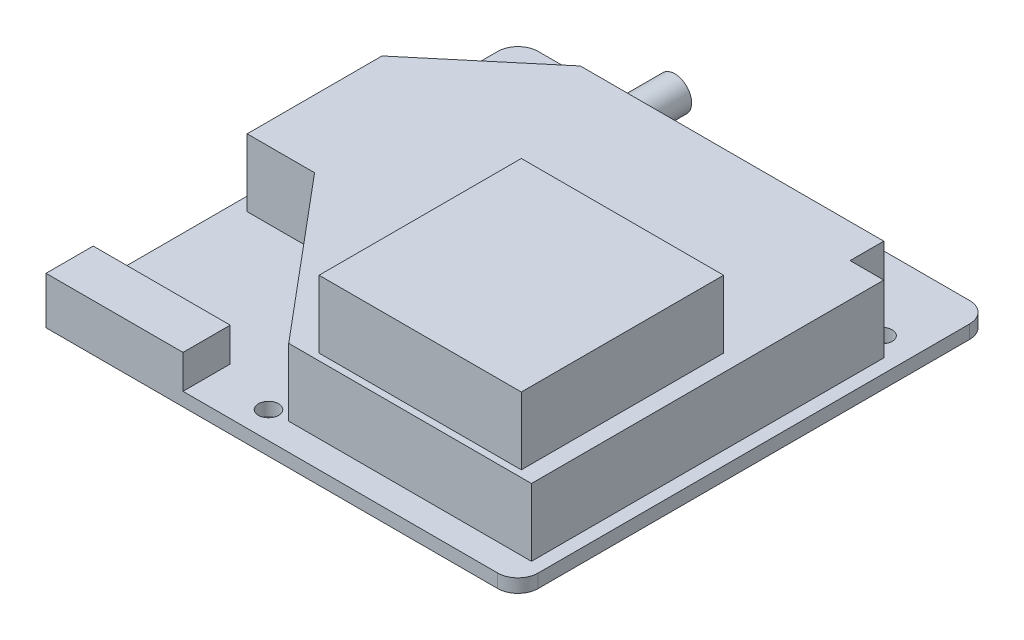
ISO-10303-21;
HEADER;
FILE_DESCRIPTION(('STEP AP214'),'2;1');
FILE_NAME('part.step','',(''),(''),'','','');
FILE_SCHEMA(('AUTOMOTIVE_DESIGN { 1 0 10303 214 1 1 1 1 }'));
ENDSEC;
DATA;
#1=APPLICATION_CONTEXT('core data for automotive mechanical design processes');
#2=APPLICATION_PROTOCOL_DEFINITION('international standard','automotive_design',2000,#1);
#3=PRODUCT_CONTEXT('',#1,'mechanical');
#4=PRODUCT('Part','Part','',(#3));
#5=PRODUCT_RELATED_PRODUCT_CATEGORY('part','',(#4));
#6=PRODUCT_DEFINITION_FORMATION('','',#4);
#7=PRODUCT_DEFINITION_CONTEXT('part definition',#1,'design');
#8=PRODUCT_DEFINITION('design','',#6,#7);
#9=PRODUCT_DEFINITION_SHAPE('','',#8);
#10=(LENGTH_UNIT() NAMED_UNIT(*) SI_UNIT(.MILLI.,.METRE.));
#11=(NAMED_UNIT(*) PLANE_ANGLE_UNIT() SI_UNIT($,.RADIAN.));
#12=(NAMED_UNIT(*) SI_UNIT($,.STERADIAN.) SOLID_ANGLE_UNIT());
#13=UNCERTAINTY_MEASURE_WITH_UNIT(LENGTH_MEASURE(1.E-05),#10,'distance_accuracy_value','');
#14=(GEOMETRIC_REPRESENTATION_CONTEXT(3) GLOBAL_UNCERTAINTY_ASSIGNED_CONTEXT((#13)) GLOBAL_UNIT_ASSIGNED_CONTEXT((#10,
#11,#12)) REPRESENTATION_CONTEXT('',''));
#15=CARTESIAN_POINT('',(0.,0.,0.));
#16=DIRECTION('',(0.,0.,1.));
#17=DIRECTION('',(1.,0.,0.));
#18=AXIS2_PLACEMENT_3D('',#15,#16,#17);
#19=CARTESIAN_POINT('',(0.,0.,0.));
#20=DIRECTION('',(0.,1.,0.));
#21=DIRECTION('',(0.,0.,1.));
#22=AXIS2_PLACEMENT_3D('',#19,#20,#21);
#23=PLANE('',#22);
#24=CARTESIAN_POINT('',(30.,0.,-24.));
#25=DIRECTION('',(0.,1.,0.));
#26=DIRECTION('',(0.,0.,1.));
#27=AXIS2_PLACEMENT_3D('',#24,#25,#26);
#28=CIRCLE('',#27,1.5);
#29=CARTESIAN_POINT('',(30.,0.,-22.5));
#30=VERTEX_POINT('',#29);
#31=EDGE_CURVE('E369',#30,#30,#28,.T.);
#32=ORIENTED_EDGE('',*,*,#31,.T.);
#33=EDGE_LOOP('',(#32));
#34=FACE_BOUND('',#33,.T.);
#35=CARTESIAN_POINT('',(-30.,0.,-24.));
#36=DIRECTION('',(0.,1.,0.));
#37=DIRECTION('',(0.,0.,1.));
#38=AXIS2_PLACEMENT_3D('',#35,#36,#37);
#39=CIRCLE('',#38,1.5);
#40=CARTESIAN_POINT('',(-30.,0.,-22.5));
#41=VERTEX_POINT('',#40);
#42=EDGE_CURVE('E373',#41,#41,#39,.T.);
#43=ORIENTED_EDGE('',*,*,#42,.T.);
#44=EDGE_LOOP('',(#43));
#45=FACE_BOUND('',#44,.T.);
#46=CARTESIAN_POINT('',(-5.99999999999998,0.,31.));
#47=DIRECTION('',(0.,1.,0.));
#48=DIRECTION('',(0.,0.,1.));
#49=AXIS2_PLACEMENT_3D('',#46,#47,#48);
#50=CIRCLE('',#49,1.5);
#51=CARTESIAN_POINT('',(-5.99999999999998,0.,32.5));
#52=VERTEX_POINT('',#51);
#53=EDGE_CURVE('E379',#52,#52,#50,.T.);
#54=ORIENTED_EDGE('',*,*,#53,.T.);
#55=EDGE_LOOP('',(#54));
#56=FACE_BOUND('',#55,.T.);
#57=DIRECTION('',(0.,0.,-1.));
#58=VECTOR('',#57,1.);
#59=CARTESIAN_POINT('',(35.,0.,-35.));
#60=LINE('',#59,#58);
#61=CARTESIAN_POINT('',(35.,0.,32.));
#62=VERTEX_POINT('',#61);
#63=CARTESIAN_POINT('',(35.,0.,-32.));
#64=VERTEX_POINT('',#63);
#65=EDGE_CURVE('E404',#62,#64,#60,.T.);
#66=ORIENTED_EDGE('',*,*,#65,.F.);
#67=CARTESIAN_POINT('',(32.,0.,32.));
#68=DIRECTION('',(0.,1.,0.));
#69=DIRECTION('',(0.,0.,1.));
#70=AXIS2_PLACEMENT_3D('',#67,#68,#69);
#71=CIRCLE('',#70,3.);
#72=CARTESIAN_POINT('',(32.,0.,35.));
#73=VERTEX_POINT('',#72);
#74=EDGE_CURVE('E422',#62,#73,#71,.F.);
#75=ORIENTED_EDGE('',*,*,#74,.T.);
#76=DIRECTION('',(1.,0.,0.));
#77=VECTOR('',#76,1.);
#78=CARTESIAN_POINT('',(-35.,0.,35.));
#79=LINE('',#78,#77);
#80=CARTESIAN_POINT('',(-35.,0.,35.));
#81=VERTEX_POINT('',#80);
#82=EDGE_CURVE('E401',#81,#73,#79,.T.);
#83=ORIENTED_EDGE('',*,*,#82,.F.);
#84=DIRECTION('',(0.,0.,1.));
#85=VECTOR('',#84,1.);
#86=CARTESIAN_POINT('',(-35.,0.,-35.));
#87=LINE('',#86,#85);
#88=CARTESIAN_POINT('',(-35.,0.,-32.));
#89=VERTEX_POINT('',#88);
#90=EDGE_CURVE('E385',#89,#81,#87,.T.);
#91=ORIENTED_EDGE('',*,*,#90,.F.);
#92=CARTESIAN_POINT('',(-32.,0.,-32.));
#93=DIRECTION('',(0.,1.,0.));
#94=DIRECTION('',(0.,0.,1.));
#95=AXIS2_PLACEMENT_3D('',#92,#93,#94);
#96=CIRCLE('',#95,3.);
#97=CARTESIAN_POINT('',(-32.,0.,-35.));
#98=VERTEX_POINT('',#97);
#99=EDGE_CURVE('E418',#89,#98,#96,.F.);
#100=ORIENTED_EDGE('',*,*,#99,.T.);
#101=DIRECTION('',(-1.,0.,0.));
#102=VECTOR('',#101,1.);
#103=CARTESIAN_POINT('',(-35.,0.,-35.));
#104=LINE('',#103,#102);
#105=CARTESIAN_POINT('',(32.,0.,-35.));
#106=VERTEX_POINT('',#105);
#107=EDGE_CURVE('E391',#106,#98,#104,.T.);
#108=ORIENTED_EDGE('',*,*,#107,.F.);
#109=CARTESIAN_POINT('',(32.,0.,-32.));
#110=DIRECTION('',(0.,1.,0.));
#111=DIRECTION('',(0.,0.,1.));
#112=AXIS2_PLACEMENT_3D('',#109,#110,#111);
#113=CIRCLE('',#112,3.);
#114=EDGE_CURVE('E420',#106,#64,#113,.F.);
#115=ORIENTED_EDGE('',*,*,#114,.T.);
#116=EDGE_LOOP('',(#66,#75,#83,#91,#100,#108,#115));
#117=FACE_BOUND('',#116,.T.);
#118=DIRECTION('',(0.,0.,1.));
#119=VECTOR('',#118,1.);
#120=CARTESIAN_POINT('',(-2.,0.,-25.));
#121=LINE('',#120,#119);
#122=CARTESIAN_POINT('',(-2.,0.,-25.));
#123=VERTEX_POINT('',#122);
#124=CARTESIAN_POINT('',(-2.,0.,0.));
#125=VERTEX_POINT('',#124);
#126=EDGE_CURVE('E237',#123,#125,#121,.T.);
#127=ORIENTED_EDGE('',*,*,#126,.F.);
#128=DIRECTION('',(1.,0.,0.));
#129=VECTOR('',#128,1.);
#130=CARTESIAN_POINT('',(-2.,0.,-25.));
#131=LINE('',#130,#129);
#132=CARTESIAN_POINT('',(-27.,0.,-25.));
#133=VERTEX_POINT('',#132);
#134=EDGE_CURVE('E234',#133,#123,#131,.T.);
#135=ORIENTED_EDGE('',*,*,#134,.F.);
#136=DIRECTION('',(0.,0.,-1.));
#137=VECTOR('',#136,1.);
#138=CARTESIAN_POINT('',(-27.,0.,-25.));
#139=LINE('',#138,#137);
#140=CARTESIAN_POINT('',(-27.,0.,0.));
#141=VERTEX_POINT('',#140);
#142=EDGE_CURVE('E894',#141,#133,#139,.T.);
#143=ORIENTED_EDGE('',*,*,#142,.F.);
#144=DIRECTION('',(-1.,0.,0.));
#145=VECTOR('',#144,1.);
#146=CARTESIAN_POINT('',(-2.,0.,0.));
#147=LINE('',#146,#145);
#148=EDGE_CURVE('E900',#125,#141,#147,.T.);
#149=ORIENTED_EDGE('',*,*,#148,.F.);
#150=EDGE_LOOP('',(#127,#135,#143,#149));
#151=FACE_BOUND('',#150,.T.);
#152=ADVANCED_FACE('F32',(#34,#45,#56,#117,#151),#23,.F.);
#153=CARTESIAN_POINT('',(0.,12.,0.));
#154=DIRECTION('',(0.,1.,0.));
#155=DIRECTION('',(0.,0.,1.));
#156=AXIS2_PLACEMENT_3D('',#153,#154,#155);
#157=PLANE('',#156);
#158=DIRECTION('',(0.,0.,1.));
#159=VECTOR('',#158,1.);
#160=CARTESIAN_POINT('',(-33.,12.,-12.8350718518843));
#161=LINE('',#160,#159);
#162=CARTESIAN_POINT('',(-33.,12.,-12.8350718518843));
#163=VERTEX_POINT('',#162);
#164=CARTESIAN_POINT('',(-33.,12.,7.16492814811568));
#165=VERTEX_POINT('',#164);
#166=EDGE_CURVE('E282',#163,#165,#161,.T.);
#167=ORIENTED_EDGE('',*,*,#166,.T.);
#168=DIRECTION('',(1.,0.,0.));
#169=VECTOR('',#168,1.);
#170=CARTESIAN_POINT('',(-33.,12.,7.16492814811568));
#171=LINE('',#170,#169);
#172=CARTESIAN_POINT('',(-23.,12.,7.16492814811568));
#173=VERTEX_POINT('',#172);
#174=EDGE_CURVE('E285',#165,#173,#171,.T.);
#175=ORIENTED_EDGE('',*,*,#174,.T.);
#176=DIRECTION('',(0.642787609686538,0.,0.766044443118979));
#177=VECTOR('',#176,1.);
#178=CARTESIAN_POINT('',(-23.,12.,7.16492814811568));
#179=LINE('',#178,#177);
#180=CARTESIAN_POINT('',(-2.99999999999998,12.,31.));
#181=VERTEX_POINT('',#180);
#182=EDGE_CURVE('E288',#173,#181,#179,.T.);
#183=ORIENTED_EDGE('',*,*,#182,.T.);
#184=DIRECTION('',(1.,0.,0.));
#185=VECTOR('',#184,1.);
#186=CARTESIAN_POINT('',(-2.99999999999998,12.,31.));
#187=LINE('',#186,#185);
#188=CARTESIAN_POINT('',(33.,12.,31.));
#189=VERTEX_POINT('',#188);
#190=EDGE_CURVE('E290',#181,#189,#187,.T.);
#191=ORIENTED_EDGE('',*,*,#190,.T.);
#192=DIRECTION('',(0.,0.,-1.));
#193=VECTOR('',#192,1.);
#194=CARTESIAN_POINT('',(33.,12.,31.));
#195=LINE('',#194,#193);
#196=CARTESIAN_POINT('',(33.,12.,-21.2606659507207));
#197=VERTEX_POINT('',#196);
#198=EDGE_CURVE('E292',#189,#197,#195,.T.);
#199=ORIENTED_EDGE('',*,*,#198,.T.);
#200=DIRECTION('',(-1.,0.,0.));
#201=VECTOR('',#200,1.);
#202=CARTESIAN_POINT('',(33.,12.,-21.2606659507207));
#203=LINE('',#202,#201);
#204=CARTESIAN_POINT('',(28.,12.,-21.2606659507207));
#205=VERTEX_POINT('',#204);
#206=EDGE_CURVE('E294',#197,#205,#203,.T.);
#207=ORIENTED_EDGE('',*,*,#206,.T.);
#208=DIRECTION('',(0.,0.,-1.));
#209=VECTOR('',#208,1.);
#210=CARTESIAN_POINT('',(28.,12.,-21.2606659507207));
#211=LINE('',#210,#209);
#212=CARTESIAN_POINT('',(28.,12.,-26.2606659507207));
#213=VERTEX_POINT('',#212);
#214=EDGE_CURVE('E296',#205,#213,#211,.T.);
#215=ORIENTED_EDGE('',*,*,#214,.T.);
#216=DIRECTION('',(-1.,0.,0.));
#217=VECTOR('',#216,1.);
#218=CARTESIAN_POINT('',(28.,12.,-26.2606659507207));
#219=LINE('',#218,#217);
#220=CARTESIAN_POINT('',(-17.,12.,-26.2606659507207));
#221=VERTEX_POINT('',#220);
#222=EDGE_CURVE('E298',#213,#221,#219,.T.);
#223=ORIENTED_EDGE('',*,*,#222,.T.);
#224=DIRECTION('',(-0.766044443118979,0.,0.642787609686537));
#225=VECTOR('',#224,1.);
#226=CARTESIAN_POINT('',(-17.,12.,-26.2606659507207));
#227=LINE('',#226,#225);
#228=EDGE_CURVE('E300',#221,#163,#227,.T.);
#229=ORIENTED_EDGE('',*,*,#228,.T.);
#230=EDGE_LOOP('',(#167,#175,#183,#191,#199,#207,#215,#223,#229));
#231=FACE_BOUND('',#230,.T.);
#232=DIRECTION('',(1.,0.,0.));
#233=VECTOR('',#232,1.);
#234=CARTESIAN_POINT('',(0.500000000000008,12.,30.));
#235=LINE('',#234,#233);
#236=CARTESIAN_POINT('',(0.500000000000008,12.,30.));
#237=VERTEX_POINT('',#236);
#238=CARTESIAN_POINT('',(30.5,12.,30.));
#239=VERTEX_POINT('',#238);
#240=EDGE_CURVE('E266',#237,#239,#235,.T.);
#241=ORIENTED_EDGE('',*,*,#240,.F.);
#242=DIRECTION('',(0.,0.,1.));
#243=VECTOR('',#242,1.);
#244=CARTESIAN_POINT('',(0.500000000000004,12.,0.));
#245=LINE('',#244,#243);
#246=CARTESIAN_POINT('',(0.500000000000004,12.,0.));
#247=VERTEX_POINT('',#246);
#248=EDGE_CURVE('E252',#247,#237,#245,.T.);
#249=ORIENTED_EDGE('',*,*,#248,.F.);
#250=DIRECTION('',(-1.,0.,0.));
#251=VECTOR('',#250,1.);
#252=CARTESIAN_POINT('',(0.500000000000004,12.,0.));
#253=LINE('',#252,#251);
#254=CARTESIAN_POINT('',(30.5,12.,0.));
#255=VERTEX_POINT('',#254);
#256=EDGE_CURVE('E257',#255,#247,#253,.T.);
#257=ORIENTED_EDGE('',*,*,#256,.F.);
#258=DIRECTION('',(0.,0.,-1.));
#259=VECTOR('',#258,1.);
#260=CARTESIAN_POINT('',(30.5,12.,0.));
#261=LINE('',#260,#259);
#262=EDGE_CURVE('E268',#239,#255,#261,.T.);
#263=ORIENTED_EDGE('',*,*,#262,.F.);
#264=EDGE_LOOP('',(#241,#249,#257,#263));
#265=FACE_BOUND('',#264,.T.);
#266=ADVANCED_FACE('F479',(#231,#265),#157,.T.);
#267=CARTESIAN_POINT('',(0.,2.,0.));
#268=DIRECTION('',(0.,1.,0.));
#269=DIRECTION('',(0.,0.,1.));
#270=AXIS2_PLACEMENT_3D('',#267,#268,#269);
#271=PLANE('',#270);
#272=DIRECTION('',(1.,0.,0.));
#273=VECTOR('',#272,1.);
#274=CARTESIAN_POINT('',(-35.,2.,35.));
#275=LINE('',#274,#273);
#276=CARTESIAN_POINT('',(-14.68,2.,35.));
#277=VERTEX_POINT('',#276);
#278=CARTESIAN_POINT('',(32.,2.,35.));
#279=VERTEX_POINT('',#278);
#280=EDGE_CURVE('E390',#277,#279,#275,.T.);
#281=ORIENTED_EDGE('',*,*,#280,.T.);
#282=CARTESIAN_POINT('',(32.,2.,32.));
#283=DIRECTION('',(0.,1.,0.));
#284=DIRECTION('',(0.,0.,1.));
#285=AXIS2_PLACEMENT_3D('',#282,#283,#284);
#286=CIRCLE('',#285,3.);
#287=CARTESIAN_POINT('',(35.,2.,32.));
#288=VERTEX_POINT('',#287);
#289=EDGE_CURVE('E429',#279,#288,#286,.T.);
#290=ORIENTED_EDGE('',*,*,#289,.T.);
#291=DIRECTION('',(0.,0.,-1.));
#292=VECTOR('',#291,1.);
#293=CARTESIAN_POINT('',(35.,2.,-35.));
#294=LINE('',#293,#292);
#295=CARTESIAN_POINT('',(35.,2.,-32.));
#296=VERTEX_POINT('',#295);
#297=EDGE_CURVE('E394',#288,#296,#294,.T.);
#298=ORIENTED_EDGE('',*,*,#297,.T.);
#299=CARTESIAN_POINT('',(32.,2.,-32.));
#300=DIRECTION('',(0.,1.,0.));
#301=DIRECTION('',(0.,0.,1.));
#302=AXIS2_PLACEMENT_3D('',#299,#300,#301);
#303=CIRCLE('',#302,3.);
#304=CARTESIAN_POINT('',(32.,2.,-35.));
#305=VERTEX_POINT('',#304);
#306=EDGE_CURVE('E427',#296,#305,#303,.T.);
#307=ORIENTED_EDGE('',*,*,#306,.T.);
#308=DIRECTION('',(-1.,0.,0.));
#309=VECTOR('',#308,1.);
#310=CARTESIAN_POINT('',(-35.,2.,-35.));
#311=LINE('',#310,#309);
#312=CARTESIAN_POINT('',(-32.,2.,-35.));
#313=VERTEX_POINT('',#312);
#314=EDGE_CURVE('E397',#305,#313,#311,.T.);
#315=ORIENTED_EDGE('',*,*,#314,.T.);
#316=CARTESIAN_POINT('',(-32.,2.,-32.));
#317=DIRECTION('',(0.,1.,0.));
#318=DIRECTION('',(0.,0.,1.));
#319=AXIS2_PLACEMENT_3D('',#316,#317,#318);
#320=CIRCLE('',#319,3.);
#321=CARTESIAN_POINT('',(-35.,2.,-32.));
#322=VERTEX_POINT('',#321);
#323=EDGE_CURVE('E47',#313,#322,#320,.T.);
#324=ORIENTED_EDGE('',*,*,#323,.T.);
#325=DIRECTION('',(0.,0.,1.));
#326=VECTOR('',#325,1.);
#327=CARTESIAN_POINT('',(-35.,2.,-35.));
#328=LINE('',#327,#326);
#329=CARTESIAN_POINT('',(-35.,2.,28.));
#330=VERTEX_POINT('',#329);
#331=EDGE_CURVE('E388',#322,#330,#328,.T.);
#332=ORIENTED_EDGE('',*,*,#331,.T.);
#333=DIRECTION('',(-1.,0.,0.));
#334=VECTOR('',#333,1.);
#335=CARTESIAN_POINT('',(-35.,2.,28.));
#336=LINE('',#335,#334);
#337=CARTESIAN_POINT('',(-14.68,2.,28.));
#338=VERTEX_POINT('',#337);
#339=EDGE_CURVE('E350',#338,#330,#336,.T.);
#340=ORIENTED_EDGE('',*,*,#339,.F.);
#341=DIRECTION('',(0.,0.,-1.));
#342=VECTOR('',#341,1.);
#343=CARTESIAN_POINT('',(-14.68,2.,28.));
#344=LINE('',#343,#342);
#345=EDGE_CURVE('E345',#277,#338,#344,.T.);
#346=ORIENTED_EDGE('',*,*,#345,.F.);
#347=EDGE_LOOP('',(#281,#290,#298,#307,#315,#324,#332,#340,#346));
#348=FACE_BOUND('',#347,.T.);
#349=CARTESIAN_POINT('',(-30.,2.,-24.));
#350=DIRECTION('',(0.,1.,0.));
#351=DIRECTION('',(0.,0.,1.));
#352=AXIS2_PLACEMENT_3D('',#349,#350,#351);
#353=CIRCLE('',#352,1.5);
#354=CARTESIAN_POINT('',(-30.,2.,-22.5));
#355=VERTEX_POINT('',#354);
#356=EDGE_CURVE('E376',#355,#355,#353,.T.);
#357=ORIENTED_EDGE('',*,*,#356,.F.);
#358=EDGE_LOOP('',(#357));
#359=FACE_BOUND('',#358,.T.);
#360=CARTESIAN_POINT('',(-5.99999999999998,2.,31.));
#361=DIRECTION('',(0.,1.,0.));
#362=DIRECTION('',(0.,0.,1.));
#363=AXIS2_PLACEMENT_3D('',#360,#361,#362);
#364=CIRCLE('',#363,1.5);
#365=CARTESIAN_POINT('',(-5.99999999999998,2.,32.5));
#366=VERTEX_POINT('',#365);
#367=EDGE_CURVE('E382',#366,#366,#364,.T.);
#368=ORIENTED_EDGE('',*,*,#367,.F.);
#369=EDGE_LOOP('',(#368));
#370=FACE_BOUND('',#369,.T.);
#371=CARTESIAN_POINT('',(30.,2.,-24.));
#372=DIRECTION('',(0.,1.,0.));
#373=DIRECTION('',(0.,0.,1.));
#374=AXIS2_PLACEMENT_3D('',#371,#372,#373);
#375=CIRCLE('',#374,1.5);
#376=CARTESIAN_POINT('',(30.,2.,-22.5));
#377=VERTEX_POINT('',#376);
#378=EDGE_CURVE('E370',#377,#377,#375,.T.);
#379=ORIENTED_EDGE('',*,*,#378,.F.);
#380=EDGE_LOOP('',(#379));
#381=FACE_BOUND('',#380,.T.);
#382=DIRECTION('',(1.,0.,0.));
#383=VECTOR('',#382,1.);
#384=CARTESIAN_POINT('',(-33.,2.,7.16492814811568));
#385=LINE('',#384,#383);
#386=CARTESIAN_POINT('',(-33.,2.,7.16492814811568));
#387=VERTEX_POINT('',#386);
#388=CARTESIAN_POINT('',(-23.,2.,7.16492814811568));
#389=VERTEX_POINT('',#388);
#390=EDGE_CURVE('E305',#387,#389,#385,.T.);
#391=ORIENTED_EDGE('',*,*,#390,.F.);
#392=DIRECTION('',(0.,0.,1.));
#393=VECTOR('',#392,1.);
#394=CARTESIAN_POINT('',(-33.,2.,-12.8350718518843));
#395=LINE('',#394,#393);
#396=CARTESIAN_POINT('',(-33.,2.,-12.8350718518843));
#397=VERTEX_POINT('',#396);
#398=EDGE_CURVE('E281',#397,#387,#395,.T.);
#399=ORIENTED_EDGE('',*,*,#398,.F.);
#400=DIRECTION('',(-0.766044443118979,0.,0.642787609686537));
#401=VECTOR('',#400,1.);
#402=CARTESIAN_POINT('',(-17.,2.,-26.2606659507207));
#403=LINE('',#402,#401);
#404=CARTESIAN_POINT('',(-17.,2.,-26.2606659507207));
#405=VERTEX_POINT('',#404);
#406=EDGE_CURVE('E286',#405,#397,#403,.T.);
#407=ORIENTED_EDGE('',*,*,#406,.F.);
#408=DIRECTION('',(-1.,0.,0.));
#409=VECTOR('',#408,1.);
#410=CARTESIAN_POINT('',(28.,2.,-26.2606659507207));
#411=LINE('',#410,#409);
#412=CARTESIAN_POINT('',(28.,2.,-26.2606659507207));
#413=VERTEX_POINT('',#412);
#414=EDGE_CURVE('E317',#413,#405,#411,.T.);
#415=ORIENTED_EDGE('',*,*,#414,.F.);
#416=DIRECTION('',(0.,0.,-1.));
#417=VECTOR('',#416,1.);
#418=CARTESIAN_POINT('',(28.,2.,-21.2606659507207));
#419=LINE('',#418,#417);
#420=CARTESIAN_POINT('',(28.,2.,-21.2606659507207));
#421=VERTEX_POINT('',#420);
#422=EDGE_CURVE('E315',#421,#413,#419,.T.);
#423=ORIENTED_EDGE('',*,*,#422,.F.);
#424=DIRECTION('',(-1.,0.,0.));
#425=VECTOR('',#424,1.);
#426=CARTESIAN_POINT('',(33.,2.,-21.2606659507207));
#427=LINE('',#426,#425);
#428=CARTESIAN_POINT('',(33.,2.,-21.2606659507207));
#429=VERTEX_POINT('',#428);
#430=EDGE_CURVE('E313',#429,#421,#427,.T.);
#431=ORIENTED_EDGE('',*,*,#430,.F.);
#432=DIRECTION('',(0.,0.,-1.));
#433=VECTOR('',#432,1.);
#434=CARTESIAN_POINT('',(33.,2.,31.));
#435=LINE('',#434,#433);
#436=CARTESIAN_POINT('',(33.,2.,31.));
#437=VERTEX_POINT('',#436);
#438=EDGE_CURVE('E311',#437,#429,#435,.T.);
#439=ORIENTED_EDGE('',*,*,#438,.F.);
#440=DIRECTION('',(1.,0.,0.));
#441=VECTOR('',#440,1.);
#442=CARTESIAN_POINT('',(-2.99999999999998,2.,31.));
#443=LINE('',#442,#441);
#444=CARTESIAN_POINT('',(-2.99999999999998,2.,31.));
#445=VERTEX_POINT('',#444);
#446=EDGE_CURVE('E309',#445,#437,#443,.T.);
#447=ORIENTED_EDGE('',*,*,#446,.F.);
#448=DIRECTION('',(0.642787609686538,0.,0.766044443118979));
#449=VECTOR('',#448,1.);
#450=CARTESIAN_POINT('',(-23.,2.,7.16492814811568));
#451=LINE('',#450,#449);
#452=EDGE_CURVE('E307',#389,#445,#451,.T.);
#453=ORIENTED_EDGE('',*,*,#452,.F.);
#454=EDGE_LOOP('',(#391,#399,#407,#415,#423,#431,#439,#447,#453));
#455=FACE_BOUND('',#454,.T.);
#456=ADVANCED_FACE('F448',(#348,#359,#370,#381,#455),#271,.T.);
#457=CARTESIAN_POINT('',(-35.,2.,-35.));
#458=DIRECTION('',(1.,0.,0.));
#459=DIRECTION('',(0.,0.,-1.));
#460=AXIS2_PLACEMENT_3D('',#457,#458,#459);
#461=PLANE('',#460);
#462=ORIENTED_EDGE('',*,*,#331,.F.);
#463=DIRECTION('',(0.,-1.,0.));
#464=VECTOR('',#463,1.);
#465=CARTESIAN_POINT('',(-35.,2.,-32.));
#466=LINE('',#465,#464);
#467=EDGE_CURVE('E11',#322,#89,#466,.T.);
#468=ORIENTED_EDGE('',*,*,#467,.T.);
#469=ORIENTED_EDGE('',*,*,#90,.T.);
#470=DIRECTION('',(0.,-1.,0.));
#471=VECTOR('',#470,1.);
#472=CARTESIAN_POINT('',(-35.,2.,35.));
#473=LINE('',#472,#471);
#474=CARTESIAN_POINT('',(-35.,7.,35.));
#475=VERTEX_POINT('',#474);
#476=EDGE_CURVE('E399',#475,#81,#473,.T.);
#477=ORIENTED_EDGE('',*,*,#476,.F.);
#478=DIRECTION('',(0.,0.,1.));
#479=VECTOR('',#478,1.);
#480=CARTESIAN_POINT('',(-35.,7.,28.));
#481=LINE('',#480,#479);
#482=CARTESIAN_POINT('',(-35.,7.,28.));
#483=VERTEX_POINT('',#482);
#484=EDGE_CURVE('E346',#483,#475,#481,.T.);
#485=ORIENTED_EDGE('',*,*,#484,.F.);
#486=DIRECTION('',(0.,-1.,0.));
#487=VECTOR('',#486,1.);
#488=CARTESIAN_POINT('',(-35.,7.,28.));
#489=LINE('',#488,#487);
#490=EDGE_CURVE('E356',#483,#330,#489,.T.);
#491=ORIENTED_EDGE('',*,*,#490,.T.);
#492=EDGE_LOOP('',(#462,#468,#469,#477,#485,#491));
#493=FACE_BOUND('',#492,.T.);
#494=ADVANCED_FACE('F445',(#493),#461,.F.);
#495=CARTESIAN_POINT('',(-35.,2.,35.));
#496=DIRECTION('',(0.,0.,-1.));
#497=DIRECTION('',(-1.,0.,0.));
#498=AXIS2_PLACEMENT_3D('',#495,#496,#497);
#499=PLANE('',#498);
#500=ORIENTED_EDGE('',*,*,#82,.T.);
#501=DIRECTION('',(0.,-1.,0.));
#502=VECTOR('',#501,1.);
#503=CARTESIAN_POINT('',(32.,2.,35.));
#504=LINE('',#503,#502);
#505=EDGE_CURVE('E424',#73,#279,#504,.F.);
#506=ORIENTED_EDGE('',*,*,#505,.T.);
#507=ORIENTED_EDGE('',*,*,#280,.F.);
#508=DIRECTION('',(0.,-1.,0.));
#509=VECTOR('',#508,1.);
#510=CARTESIAN_POINT('',(-14.68,7.,35.));
#511=LINE('',#510,#509);
#512=CARTESIAN_POINT('',(-14.68,7.,35.));
#513=VERTEX_POINT('',#512);
#514=EDGE_CURVE('E366',#513,#277,#511,.T.);
#515=ORIENTED_EDGE('',*,*,#514,.F.);
#516=DIRECTION('',(1.,0.,0.));
#517=VECTOR('',#516,1.);
#518=CARTESIAN_POINT('',(-35.,7.,35.));
#519=LINE('',#518,#517);
#520=EDGE_CURVE('E349',#475,#513,#519,.T.);
#521=ORIENTED_EDGE('',*,*,#520,.F.);
#522=ORIENTED_EDGE('',*,*,#476,.T.);
#523=EDGE_LOOP('',(#500,#506,#507,#515,#521,#522));
#524=FACE_BOUND('',#523,.T.);
#525=ADVANCED_FACE('F461',(#524),#499,.F.);
#526=CARTESIAN_POINT('',(35.,2.,-35.));
#527=DIRECTION('',(-1.,0.,0.));
#528=DIRECTION('',(0.,0.,1.));
#529=AXIS2_PLACEMENT_3D('',#526,#527,#528);
#530=PLANE('',#529);
#531=ORIENTED_EDGE('',*,*,#297,.F.);
#532=DIRECTION('',(0.,-1.,0.));
#533=VECTOR('',#532,1.);
#534=CARTESIAN_POINT('',(35.,2.,32.));
#535=LINE('',#534,#533);
#536=EDGE_CURVE('E415',#288,#62,#535,.T.);
#537=ORIENTED_EDGE('',*,*,#536,.T.);
#538=ORIENTED_EDGE('',*,*,#65,.T.);
#539=DIRECTION('',(0.,-1.,0.));
#540=VECTOR('',#539,1.);
#541=CARTESIAN_POINT('',(35.,2.,-32.));
#542=LINE('',#541,#540);
#543=EDGE_CURVE('E413',#64,#296,#542,.F.);
#544=ORIENTED_EDGE('',*,*,#543,.T.);
#545=EDGE_LOOP('',(#531,#537,#538,#544));
#546=FACE_BOUND('',#545,.T.);
#547=ADVANCED_FACE('F469',(#546),#530,.F.);
#548=CARTESIAN_POINT('',(-35.,2.,-35.));
#549=DIRECTION('',(0.,0.,1.));
#550=DIRECTION('',(1.,0.,0.));
#551=AXIS2_PLACEMENT_3D('',#548,#549,#550);
#552=PLANE('',#551);
#553=ORIENTED_EDGE('',*,*,#314,.F.);
#554=DIRECTION('',(0.,-1.,0.));
#555=VECTOR('',#554,1.);
#556=CARTESIAN_POINT('',(32.,2.,-35.));
#557=LINE('',#556,#555);
#558=EDGE_CURVE('E40',#305,#106,#557,.T.);
#559=ORIENTED_EDGE('',*,*,#558,.T.);
#560=ORIENTED_EDGE('',*,*,#107,.T.);
#561=DIRECTION('',(0.,-1.,0.));
#562=VECTOR('',#561,1.);
#563=CARTESIAN_POINT('',(-32.,2.,-35.));
#564=LINE('',#563,#562);
#565=EDGE_CURVE('E55',#98,#313,#564,.F.);
#566=ORIENTED_EDGE('',*,*,#565,.T.);
#567=EDGE_LOOP('',(#553,#559,#560,#566));
#568=FACE_BOUND('',#567,.T.);
#569=ADVANCED_FACE('F434',(#568),#552,.F.);
#570=CARTESIAN_POINT('',(-5.99999999999998,2.,31.));
#571=DIRECTION('',(0.,-1.,0.));
#572=DIRECTION('',(0.,0.,-1.));
#573=AXIS2_PLACEMENT_3D('',#570,#571,#572);
#574=CYLINDRICAL_SURFACE('',#573,1.5);
#575=ORIENTED_EDGE('',*,*,#367,.T.);
#576=EDGE_LOOP('',(#575));
#577=FACE_BOUND('',#576,.T.);
#578=ORIENTED_EDGE('',*,*,#53,.F.);
#579=EDGE_LOOP('',(#578));
#580=FACE_BOUND('',#579,.T.);
#581=ADVANCED_FACE('F493',(#577,#580),#574,.F.);
#582=CARTESIAN_POINT('',(-30.,2.,-24.));
#583=DIRECTION('',(0.,-1.,0.));
#584=DIRECTION('',(0.,0.,-1.));
#585=AXIS2_PLACEMENT_3D('',#582,#583,#584);
#586=CYLINDRICAL_SURFACE('',#585,1.5);
#587=ORIENTED_EDGE('',*,*,#356,.T.);
#588=EDGE_LOOP('',(#587));
#589=FACE_BOUND('',#588,.T.);
#590=ORIENTED_EDGE('',*,*,#42,.F.);
#591=EDGE_LOOP('',(#590));
#592=FACE_BOUND('',#591,.T.);
#593=ADVANCED_FACE('F720',(#589,#592),#586,.F.);
#594=CARTESIAN_POINT('',(30.,2.,-24.));
#595=DIRECTION('',(0.,-1.,0.));
#596=DIRECTION('',(0.,0.,-1.));
#597=AXIS2_PLACEMENT_3D('',#594,#595,#596);
#598=CYLINDRICAL_SURFACE('',#597,1.5);
#599=ORIENTED_EDGE('',*,*,#378,.T.);
#600=EDGE_LOOP('',(#599));
#601=FACE_BOUND('',#600,.T.);
#602=ORIENTED_EDGE('',*,*,#31,.F.);
#603=EDGE_LOOP('',(#602));
#604=FACE_BOUND('',#603,.T.);
#605=ADVANCED_FACE('F714',(#601,#604),#598,.F.);
#606=CARTESIAN_POINT('',(-14.68,7.,28.));
#607=DIRECTION('',(-1.,0.,0.));
#608=DIRECTION('',(0.,0.,1.));
#609=AXIS2_PLACEMENT_3D('',#606,#607,#608);
#610=PLANE('',#609);
#611=ORIENTED_EDGE('',*,*,#345,.T.);
#612=DIRECTION('',(0.,-1.,0.));
#613=VECTOR('',#612,1.);
#614=CARTESIAN_POINT('',(-14.68,7.,28.));
#615=LINE('',#614,#613);
#616=CARTESIAN_POINT('',(-14.68,7.,28.));
#617=VERTEX_POINT('',#616);
#618=EDGE_CURVE('E363',#617,#338,#615,.T.);
#619=ORIENTED_EDGE('',*,*,#618,.F.);
#620=DIRECTION('',(0.,0.,-1.));
#621=VECTOR('',#620,1.);
#622=CARTESIAN_POINT('',(-14.68,7.,28.));
#623=LINE('',#622,#621);
#624=EDGE_CURVE('E352',#513,#617,#623,.T.);
#625=ORIENTED_EDGE('',*,*,#624,.F.);
#626=ORIENTED_EDGE('',*,*,#514,.T.);
#627=EDGE_LOOP('',(#611,#619,#625,#626));
#628=FACE_BOUND('',#627,.T.);
#629=ADVANCED_FACE('F456',(#628),#610,.F.);
#630=CARTESIAN_POINT('',(-35.,7.,28.));
#631=DIRECTION('',(0.,0.,1.));
#632=DIRECTION('',(1.,0.,0.));
#633=AXIS2_PLACEMENT_3D('',#630,#631,#632);
#634=PLANE('',#633);
#635=ORIENTED_EDGE('',*,*,#339,.T.);
#636=ORIENTED_EDGE('',*,*,#490,.F.);
#637=DIRECTION('',(-1.,0.,0.));
#638=VECTOR('',#637,1.);
#639=CARTESIAN_POINT('',(-35.,7.,28.));
#640=LINE('',#639,#638);
#641=EDGE_CURVE('E354',#617,#483,#640,.T.);
#642=ORIENTED_EDGE('',*,*,#641,.F.);
#643=ORIENTED_EDGE('',*,*,#618,.T.);
#644=EDGE_LOOP('',(#635,#636,#642,#643));
#645=FACE_BOUND('',#644,.T.);
#646=ADVANCED_FACE('F451',(#645),#634,.F.);
#647=CARTESIAN_POINT('',(0.,7.,0.));
#648=DIRECTION('',(0.,1.,0.));
#649=DIRECTION('',(0.,0.,1.));
#650=AXIS2_PLACEMENT_3D('',#647,#648,#649);
#651=PLANE('',#650);
#652=ORIENTED_EDGE('',*,*,#484,.T.);
#653=ORIENTED_EDGE('',*,*,#520,.T.);
#654=ORIENTED_EDGE('',*,*,#624,.T.);
#655=ORIENTED_EDGE('',*,*,#641,.T.);
#656=EDGE_LOOP('',(#652,#653,#654,#655));
#657=FACE_BOUND('',#656,.T.);
#658=ADVANCED_FACE('F748',(#657),#651,.T.);
#659=CARTESIAN_POINT('',(-33.,12.,-12.8350718518843));
#660=DIRECTION('',(1.,0.,0.));
#661=DIRECTION('',(0.,0.,-1.));
#662=AXIS2_PLACEMENT_3D('',#659,#660,#661);
#663=PLANE('',#662);
#664=ORIENTED_EDGE('',*,*,#398,.T.);
#665=DIRECTION('',(0.,-1.,0.));
#666=VECTOR('',#665,1.);
#667=CARTESIAN_POINT('',(-33.,12.,7.16492814811568));
#668=LINE('',#667,#666);
#669=EDGE_CURVE('E343',#165,#387,#668,.T.);
#670=ORIENTED_EDGE('',*,*,#669,.F.);
#671=ORIENTED_EDGE('',*,*,#166,.F.);
#672=DIRECTION('',(0.,-1.,0.));
#673=VECTOR('',#672,1.);
#674=CARTESIAN_POINT('',(-33.,12.,-12.8350718518843));
#675=LINE('',#674,#673);
#676=EDGE_CURVE('E302',#163,#397,#675,.T.);
#677=ORIENTED_EDGE('',*,*,#676,.T.);
#678=EDGE_LOOP('',(#664,#670,#671,#677));
#679=FACE_BOUND('',#678,.T.);
#680=ADVANCED_FACE('F755',(#679),#663,.F.);
#681=CARTESIAN_POINT('',(-33.,12.,7.16492814811568));
#682=DIRECTION('',(0.,0.,-1.));
#683=DIRECTION('',(-1.,0.,0.));
#684=AXIS2_PLACEMENT_3D('',#681,#682,#683);
#685=PLANE('',#684);
#686=ORIENTED_EDGE('',*,*,#390,.T.);
#687=DIRECTION('',(0.,-1.,0.));
#688=VECTOR('',#687,1.);
#689=CARTESIAN_POINT('',(-23.,12.,7.16492814811568));
#690=LINE('',#689,#688);
#691=EDGE_CURVE('E340',#173,#389,#690,.T.);
#692=ORIENTED_EDGE('',*,*,#691,.F.);
#693=ORIENTED_EDGE('',*,*,#174,.F.);
#694=ORIENTED_EDGE('',*,*,#669,.T.);
#695=EDGE_LOOP('',(#686,#692,#693,#694));
#696=FACE_BOUND('',#695,.T.);
#697=ADVANCED_FACE('F763',(#696),#685,.F.);
#698=CARTESIAN_POINT('',(-23.,12.,7.16492814811568));
#699=DIRECTION('',(0.766044443118979,0.,-0.642787609686538));
#700=DIRECTION('',(-0.642787609686538,0.,-0.766044443118979));
#701=AXIS2_PLACEMENT_3D('',#698,#699,#700);
#702=PLANE('',#701);
#703=ORIENTED_EDGE('',*,*,#452,.T.);
#704=DIRECTION('',(0.,-1.,0.));
#705=VECTOR('',#704,1.);
#706=CARTESIAN_POINT('',(-2.99999999999998,12.,31.));
#707=LINE('',#706,#705);
#708=EDGE_CURVE('E337',#181,#445,#707,.T.);
#709=ORIENTED_EDGE('',*,*,#708,.F.);
#710=ORIENTED_EDGE('',*,*,#182,.F.);
#711=ORIENTED_EDGE('',*,*,#691,.T.);
#712=EDGE_LOOP('',(#703,#709,#710,#711));
#713=FACE_BOUND('',#712,.T.);
#714=ADVANCED_FACE('F771',(#713),#702,.F.);
#715=CARTESIAN_POINT('',(-2.99999999999998,12.,31.));
#716=DIRECTION('',(0.,0.,-1.));
#717=DIRECTION('',(-1.,0.,0.));
#718=AXIS2_PLACEMENT_3D('',#715,#716,#717);
#719=PLANE('',#718);
#720=ORIENTED_EDGE('',*,*,#446,.T.);
#721=DIRECTION('',(0.,-1.,0.));
#722=VECTOR('',#721,1.);
#723=CARTESIAN_POINT('',(33.,12.,31.));
#724=LINE('',#723,#722);
#725=EDGE_CURVE('E334',#189,#437,#724,.T.);
#726=ORIENTED_EDGE('',*,*,#725,.F.);
#727=ORIENTED_EDGE('',*,*,#190,.F.);
#728=ORIENTED_EDGE('',*,*,#708,.T.);
#729=EDGE_LOOP('',(#720,#726,#727,#728));
#730=FACE_BOUND('',#729,.T.);
#731=ADVANCED_FACE('F779',(#730),#719,.F.);
#732=CARTESIAN_POINT('',(33.,12.,31.));
#733=DIRECTION('',(-1.,0.,0.));
#734=DIRECTION('',(0.,0.,1.));
#735=AXIS2_PLACEMENT_3D('',#732,#733,#734);
#736=PLANE('',#735);
#737=ORIENTED_EDGE('',*,*,#438,.T.);
#738=DIRECTION('',(0.,-1.,0.));
#739=VECTOR('',#738,1.);
#740=CARTESIAN_POINT('',(33.,12.,-21.2606659507207));
#741=LINE('',#740,#739);
#742=EDGE_CURVE('E331',#197,#429,#741,.T.);
#743=ORIENTED_EDGE('',*,*,#742,.F.);
#744=ORIENTED_EDGE('',*,*,#198,.F.);
#745=ORIENTED_EDGE('',*,*,#725,.T.);
#746=EDGE_LOOP('',(#737,#743,#744,#745));
#747=FACE_BOUND('',#746,.T.);
#748=ADVANCED_FACE('F787',(#747),#736,.F.);
#749=CARTESIAN_POINT('',(33.,12.,-21.2606659507207));
#750=DIRECTION('',(0.,0.,1.));
#751=DIRECTION('',(1.,0.,0.));
#752=AXIS2_PLACEMENT_3D('',#749,#750,#751);
#753=PLANE('',#752);
#754=ORIENTED_EDGE('',*,*,#430,.T.);
#755=DIRECTION('',(0.,-1.,0.));
#756=VECTOR('',#755,1.);
#757=CARTESIAN_POINT('',(28.,12.,-21.2606659507207));
#758=LINE('',#757,#756);
#759=EDGE_CURVE('E328',#205,#421,#758,.T.);
#760=ORIENTED_EDGE('',*,*,#759,.F.);
#761=ORIENTED_EDGE('',*,*,#206,.F.);
#762=ORIENTED_EDGE('',*,*,#742,.T.);
#763=EDGE_LOOP('',(#754,#760,#761,#762));
#764=FACE_BOUND('',#763,.T.);
#765=ADVANCED_FACE('F795',(#764),#753,.F.);
#766=CARTESIAN_POINT('',(28.,12.,-21.2606659507207));
#767=DIRECTION('',(-1.,0.,0.));
#768=DIRECTION('',(0.,0.,1.));
#769=AXIS2_PLACEMENT_3D('',#766,#767,#768);
#770=PLANE('',#769);
#771=ORIENTED_EDGE('',*,*,#422,.T.);
#772=DIRECTION('',(0.,-1.,0.));
#773=VECTOR('',#772,1.);
#774=CARTESIAN_POINT('',(28.,12.,-26.2606659507207));
#775=LINE('',#774,#773);
#776=EDGE_CURVE('E325',#213,#413,#775,.T.);
#777=ORIENTED_EDGE('',*,*,#776,.F.);
#778=ORIENTED_EDGE('',*,*,#214,.F.);
#779=ORIENTED_EDGE('',*,*,#759,.T.);
#780=EDGE_LOOP('',(#771,#777,#778,#779));
#781=FACE_BOUND('',#780,.T.);
#782=ADVANCED_FACE('F577',(#781),#770,.F.);
#783=CARTESIAN_POINT('',(28.,12.,-26.2606659507207));
#784=DIRECTION('',(0.,0.,1.));
#785=DIRECTION('',(1.,0.,0.));
#786=AXIS2_PLACEMENT_3D('',#783,#784,#785);
#787=PLANE('',#786);
#788=CARTESIAN_POINT('',(-13.,5.5,-26.2606659507207));
#789=DIRECTION('',(0.,0.,1.));
#790=DIRECTION('',(1.,0.,0.));
#791=AXIS2_PLACEMENT_3D('',#788,#789,#790);
#792=CIRCLE('',#791,2.5);
#793=CARTESIAN_POINT('',(-10.5,5.5,-26.2606659507207));
#794=VERTEX_POINT('',#793);
#795=EDGE_CURVE('E410',#794,#794,#792,.F.);
#796=ORIENTED_EDGE('',*,*,#795,.F.);
#797=EDGE_LOOP('',(#796));
#798=FACE_BOUND('',#797,.T.);
#799=ORIENTED_EDGE('',*,*,#414,.T.);
#800=DIRECTION('',(0.,-1.,0.));
#801=VECTOR('',#800,1.);
#802=CARTESIAN_POINT('',(-17.,12.,-26.2606659507207));
#803=LINE('',#802,#801);
#804=EDGE_CURVE('E323',#221,#405,#803,.T.);
#805=ORIENTED_EDGE('',*,*,#804,.F.);
#806=ORIENTED_EDGE('',*,*,#222,.F.);
#807=ORIENTED_EDGE('',*,*,#776,.T.);
#808=EDGE_LOOP('',(#799,#805,#806,#807));
#809=FACE_BOUND('',#808,.T.);
#810=ADVANCED_FACE('F572',(#798,#809),#787,.F.);
#811=CARTESIAN_POINT('',(-17.,12.,-26.2606659507207));
#812=DIRECTION('',(0.642787609686537,0.,0.766044443118979));
#813=DIRECTION('',(0.76604444311898,0.,-0.642787609686538));
#814=AXIS2_PLACEMENT_3D('',#811,#812,#813);
#815=PLANE('',#814);
#816=ORIENTED_EDGE('',*,*,#406,.T.);
#817=ORIENTED_EDGE('',*,*,#676,.F.);
#818=ORIENTED_EDGE('',*,*,#228,.F.);
#819=ORIENTED_EDGE('',*,*,#804,.T.);
#820=EDGE_LOOP('',(#816,#817,#818,#819));
#821=FACE_BOUND('',#820,.T.);
#822=ADVANCED_FACE('F516',(#821),#815,.F.);
#823=CARTESIAN_POINT('',(0.500000000000004,22.,0.));
#824=DIRECTION('',(1.,0.,0.));
#825=DIRECTION('',(0.,0.,-1.));
#826=AXIS2_PLACEMENT_3D('',#823,#824,#825);
#827=PLANE('',#826);
#828=ORIENTED_EDGE('',*,*,#248,.T.);
#829=DIRECTION('',(0.,-1.,0.));
#830=VECTOR('',#829,1.);
#831=CARTESIAN_POINT('',(0.500000000000008,22.,30.));
#832=LINE('',#831,#830);
#833=CARTESIAN_POINT('',(0.500000000000008,22.,30.));
#834=VERTEX_POINT('',#833);
#835=EDGE_CURVE('E279',#834,#237,#832,.T.);
#836=ORIENTED_EDGE('',*,*,#835,.F.);
#837=DIRECTION('',(0.,0.,1.));
#838=VECTOR('',#837,1.);
#839=CARTESIAN_POINT('',(0.500000000000004,22.,0.));
#840=LINE('',#839,#838);
#841=CARTESIAN_POINT('',(0.500000000000004,22.,0.));
#842=VERTEX_POINT('',#841);
#843=EDGE_CURVE('E253',#842,#834,#840,.T.);
#844=ORIENTED_EDGE('',*,*,#843,.F.);
#845=DIRECTION('',(0.,-1.,0.));
#846=VECTOR('',#845,1.);
#847=CARTESIAN_POINT('',(0.500000000000004,22.,0.));
#848=LINE('',#847,#846);
#849=EDGE_CURVE('E263',#842,#247,#848,.T.);
#850=ORIENTED_EDGE('',*,*,#849,.T.);
#851=EDGE_LOOP('',(#828,#836,#844,#850));
#852=FACE_BOUND('',#851,.T.);
#853=ADVANCED_FACE('F520',(#852),#827,.F.);
#854=CARTESIAN_POINT('',(0.500000000000008,22.,30.));
#855=DIRECTION('',(0.,0.,-1.));
#856=DIRECTION('',(-1.,0.,0.));
#857=AXIS2_PLACEMENT_3D('',#854,#855,#856);
#858=PLANE('',#857);
#859=ORIENTED_EDGE('',*,*,#240,.T.);
#860=DIRECTION('',(0.,-1.,0.));
#861=VECTOR('',#860,1.);
#862=CARTESIAN_POINT('',(30.5,22.,30.));
#863=LINE('',#862,#861);
#864=CARTESIAN_POINT('',(30.5,22.,30.));
#865=VERTEX_POINT('',#864);
#866=EDGE_CURVE('E276',#865,#239,#863,.T.);
#867=ORIENTED_EDGE('',*,*,#866,.F.);
#868=DIRECTION('',(1.,0.,0.));
#869=VECTOR('',#868,1.);
#870=CARTESIAN_POINT('',(0.500000000000008,22.,30.));
#871=LINE('',#870,#869);
#872=EDGE_CURVE('E256',#834,#865,#871,.T.);
#873=ORIENTED_EDGE('',*,*,#872,.F.);
#874=ORIENTED_EDGE('',*,*,#835,.T.);
#875=EDGE_LOOP('',(#859,#867,#873,#874));
#876=FACE_BOUND('',#875,.T.);
#877=ADVANCED_FACE('F524',(#876),#858,.F.);
#878=CARTESIAN_POINT('',(30.5,22.,0.));
#879=DIRECTION('',(-1.,0.,0.));
#880=DIRECTION('',(0.,0.,1.));
#881=AXIS2_PLACEMENT_3D('',#878,#879,#880);
#882=PLANE('',#881);
#883=ORIENTED_EDGE('',*,*,#262,.T.);
#884=DIRECTION('',(0.,-1.,0.));
#885=VECTOR('',#884,1.);
#886=CARTESIAN_POINT('',(30.5,22.,0.));
#887=LINE('',#886,#885);
#888=CARTESIAN_POINT('',(30.5,22.,0.));
#889=VERTEX_POINT('',#888);
#890=EDGE_CURVE('E274',#889,#255,#887,.T.);
#891=ORIENTED_EDGE('',*,*,#890,.F.);
#892=DIRECTION('',(0.,0.,-1.));
#893=VECTOR('',#892,1.);
#894=CARTESIAN_POINT('',(30.5,22.,0.));
#895=LINE('',#894,#893);
#896=EDGE_CURVE('E259',#865,#889,#895,.T.);
#897=ORIENTED_EDGE('',*,*,#896,.F.);
#898=ORIENTED_EDGE('',*,*,#866,.T.);
#899=EDGE_LOOP('',(#883,#891,#897,#898));
#900=FACE_BOUND('',#899,.T.);
#901=ADVANCED_FACE('F534',(#900),#882,.F.);
#902=CARTESIAN_POINT('',(0.500000000000004,22.,0.));
#903=DIRECTION('',(0.,0.,1.));
#904=DIRECTION('',(1.,0.,0.));
#905=AXIS2_PLACEMENT_3D('',#902,#903,#904);
#906=PLANE('',#905);
#907=ORIENTED_EDGE('',*,*,#256,.T.);
#908=ORIENTED_EDGE('',*,*,#849,.F.);
#909=DIRECTION('',(-1.,0.,0.));
#910=VECTOR('',#909,1.);
#911=CARTESIAN_POINT('',(0.500000000000004,22.,0.));
#912=LINE('',#911,#910);
#913=EDGE_CURVE('E261',#889,#842,#912,.T.);
#914=ORIENTED_EDGE('',*,*,#913,.F.);
#915=ORIENTED_EDGE('',*,*,#890,.T.);
#916=EDGE_LOOP('',(#907,#908,#914,#915));
#917=FACE_BOUND('',#916,.T.);
#918=ADVANCED_FACE('F544',(#917),#906,.F.);
#919=CARTESIAN_POINT('',(0.,22.,0.));
#920=DIRECTION('',(0.,1.,0.));
#921=DIRECTION('',(0.,0.,1.));
#922=AXIS2_PLACEMENT_3D('',#919,#920,#921);
#923=PLANE('',#922);
#924=ORIENTED_EDGE('',*,*,#843,.T.);
#925=ORIENTED_EDGE('',*,*,#872,.T.);
#926=ORIENTED_EDGE('',*,*,#896,.T.);
#927=ORIENTED_EDGE('',*,*,#913,.T.);
#928=EDGE_LOOP('',(#924,#925,#926,#927));
#929=FACE_BOUND('',#928,.T.);
#930=ADVANCED_FACE('F554',(#929),#923,.T.);
#931=CARTESIAN_POINT('',(-13.,5.5,-36.2606659507207));
#932=DIRECTION('',(0.,0.,-1.));
#933=DIRECTION('',(-1.,0.,0.));
#934=AXIS2_PLACEMENT_3D('',#931,#932,#933);
#935=PLANE('',#934);
#936=CARTESIAN_POINT('',(-13.,5.5,-36.2606659507207));
#937=DIRECTION('',(0.,0.,-1.));
#938=DIRECTION('',(-1.,0.,0.));
#939=AXIS2_PLACEMENT_3D('',#936,#937,#938);
#940=CIRCLE('',#939,2.5);
#941=CARTESIAN_POINT('',(-15.5,5.5,-36.2606659507207));
#942=VERTEX_POINT('',#941);
#943=EDGE_CURVE('E248',#942,#942,#940,.T.);
#944=ORIENTED_EDGE('',*,*,#943,.T.);
#945=EDGE_LOOP('',(#944));
#946=FACE_BOUND('',#945,.T.);
#947=CARTESIAN_POINT('',(-13.,5.5,-36.2606659507207));
#948=DIRECTION('',(0.,0.,-1.));
#949=DIRECTION('',(-1.,0.,0.));
#950=AXIS2_PLACEMENT_3D('',#947,#948,#949);
#951=CIRCLE('',#950,1.5);
#952=CARTESIAN_POINT('',(-14.5,5.5,-36.2606659507207));
#953=VERTEX_POINT('',#952);
#954=EDGE_CURVE('E241',#953,#953,#951,.T.);
#955=ORIENTED_EDGE('',*,*,#954,.F.);
#956=EDGE_LOOP('',(#955));
#957=FACE_BOUND('',#956,.T.);
#958=ADVANCED_FACE('F564',(#946,#957),#935,.T.);
#959=CARTESIAN_POINT('',(-13.,5.5,-36.2606659507207));
#960=DIRECTION('',(0.,0.,1.));
#961=DIRECTION('',(1.,0.,0.));
#962=AXIS2_PLACEMENT_3D('',#959,#960,#961);
#963=CYLINDRICAL_SURFACE('',#962,2.5);
#964=ORIENTED_EDGE('',*,*,#943,.F.);
#965=EDGE_LOOP('',(#964));
#966=FACE_BOUND('',#965,.T.);
#967=ORIENTED_EDGE('',*,*,#795,.T.);
#968=EDGE_LOOP('',(#967));
#969=FACE_BOUND('',#968,.T.);
#970=ADVANCED_FACE('F589',(#966,#969),#963,.T.);
#971=CARTESIAN_POINT('',(-13.,5.5,-36.2606659507207));
#972=DIRECTION('',(0.,0.,1.));
#973=DIRECTION('',(1.,0.,0.));
#974=AXIS2_PLACEMENT_3D('',#971,#972,#973);
#975=CYLINDRICAL_SURFACE('',#974,1.5);
#976=ORIENTED_EDGE('',*,*,#954,.T.);
#977=EDGE_LOOP('',(#976));
#978=FACE_BOUND('',#977,.T.);
#979=CARTESIAN_POINT('',(-13.,5.5,-26.2606659507207));
#980=DIRECTION('',(0.,0.,-1.));
#981=DIRECTION('',(-1.,0.,0.));
#982=AXIS2_PLACEMENT_3D('',#979,#980,#981);
#983=CIRCLE('',#982,1.5);
#984=CARTESIAN_POINT('',(-14.5,5.5,-26.2606659507207));
#985=VERTEX_POINT('',#984);
#986=EDGE_CURVE('E238',#985,#985,#983,.T.);
#987=ORIENTED_EDGE('',*,*,#986,.F.);
#988=EDGE_LOOP('',(#987));
#989=FACE_BOUND('',#988,.T.);
#990=ADVANCED_FACE('F599',(#978,#989),#975,.F.);
#991=ORIENTED_EDGE('',*,*,#986,.T.);
#992=EDGE_LOOP('',(#991));
#993=FACE_BOUND('',#992,.T.);
#994=ADVANCED_FACE('F580',(#993),#787,.F.);
#995=CARTESIAN_POINT('',(-2.,-3.5,-25.));
#996=DIRECTION('',(-1.,0.,0.));
#997=DIRECTION('',(0.,0.,1.));
#998=AXIS2_PLACEMENT_3D('',#995,#996,#997);
#999=PLANE('',#998);
#1000=ORIENTED_EDGE('',*,*,#126,.T.);
#1001=DIRECTION('',(0.,1.,0.));
#1002=VECTOR('',#1001,1.);
#1003=CARTESIAN_POINT('',(-2.,-3.5,0.));
#1004=LINE('',#1003,#1002);
#1005=CARTESIAN_POINT('',(-2.,-3.5,0.));
#1006=VERTEX_POINT('',#1005);
#1007=EDGE_CURVE('E218',#1006,#125,#1004,.T.);
#1008=ORIENTED_EDGE('',*,*,#1007,.F.);
#1009=DIRECTION('',(0.,0.,1.));
#1010=VECTOR('',#1009,1.);
#1011=CARTESIAN_POINT('',(-2.,-3.5,-25.));
#1012=LINE('',#1011,#1010);
#1013=CARTESIAN_POINT('',(-2.,-3.5,-25.));
#1014=VERTEX_POINT('',#1013);
#1015=EDGE_CURVE('E225',#1014,#1006,#1012,.T.);
#1016=ORIENTED_EDGE('',*,*,#1015,.F.);
#1017=DIRECTION('',(0.,1.,0.));
#1018=VECTOR('',#1017,1.);
#1019=CARTESIAN_POINT('',(-2.,-3.5,-25.));
#1020=LINE('',#1019,#1018);
#1021=EDGE_CURVE('E891',#1014,#123,#1020,.T.);
#1022=ORIENTED_EDGE('',*,*,#1021,.T.);
#1023=EDGE_LOOP('',(#1000,#1008,#1016,#1022));
#1024=FACE_BOUND('',#1023,.T.);
#1025=ADVANCED_FACE('F236',(#1024),#999,.F.);
#1026=CARTESIAN_POINT('',(-2.,-3.5,0.));
#1027=DIRECTION('',(0.,0.,-1.));
#1028=DIRECTION('',(-1.,0.,0.));
#1029=AXIS2_PLACEMENT_3D('',#1026,#1027,#1028);
#1030=PLANE('',#1029);
#1031=ORIENTED_EDGE('',*,*,#148,.T.);
#1032=DIRECTION('',(0.,1.,0.));
#1033=VECTOR('',#1032,1.);
#1034=CARTESIAN_POINT('',(-27.,-3.5,0.));
#1035=LINE('',#1034,#1033);
#1036=CARTESIAN_POINT('',(-27.,-3.5,0.));
#1037=VERTEX_POINT('',#1036);
#1038=EDGE_CURVE('E221',#1037,#141,#1035,.T.);
#1039=ORIENTED_EDGE('',*,*,#1038,.F.);
#1040=DIRECTION('',(-1.,0.,0.));
#1041=VECTOR('',#1040,1.);
#1042=CARTESIAN_POINT('',(-2.,-3.5,0.));
#1043=LINE('',#1042,#1041);
#1044=EDGE_CURVE('E213',#1006,#1037,#1043,.T.);
#1045=ORIENTED_EDGE('',*,*,#1044,.F.);
#1046=ORIENTED_EDGE('',*,*,#1007,.T.);
#1047=EDGE_LOOP('',(#1031,#1039,#1045,#1046));
#1048=FACE_BOUND('',#1047,.T.);
#1049=ADVANCED_FACE('F216',(#1048),#1030,.F.);
#1050=CARTESIAN_POINT('',(-27.,-3.5,-25.));
#1051=DIRECTION('',(1.,0.,0.));
#1052=DIRECTION('',(0.,0.,-1.));
#1053=AXIS2_PLACEMENT_3D('',#1050,#1051,#1052);
#1054=PLANE('',#1053);
#1055=ORIENTED_EDGE('',*,*,#142,.T.);
#1056=DIRECTION('',(0.,1.,0.));
#1057=VECTOR('',#1056,1.);
#1058=CARTESIAN_POINT('',(-27.,-3.5,-25.));
#1059=LINE('',#1058,#1057);
#1060=CARTESIAN_POINT('',(-27.,-3.5,-25.));
#1061=VERTEX_POINT('',#1060);
#1062=EDGE_CURVE('E243',#1061,#133,#1059,.T.);
#1063=ORIENTED_EDGE('',*,*,#1062,.F.);
#1064=DIRECTION('',(0.,0.,-1.));
#1065=VECTOR('',#1064,1.);
#1066=CARTESIAN_POINT('',(-27.,-3.5,-25.));
#1067=LINE('',#1066,#1065);
#1068=EDGE_CURVE('E224',#1037,#1061,#1067,.T.);
#1069=ORIENTED_EDGE('',*,*,#1068,.F.);
#1070=ORIENTED_EDGE('',*,*,#1038,.T.);
#1071=EDGE_LOOP('',(#1055,#1063,#1069,#1070));
#1072=FACE_BOUND('',#1071,.T.);
#1073=ADVANCED_FACE('F634',(#1072),#1054,.F.);
#1074=CARTESIAN_POINT('',(-2.,-3.5,-25.));
#1075=DIRECTION('',(0.,0.,1.));
#1076=DIRECTION('',(1.,0.,0.));
#1077=AXIS2_PLACEMENT_3D('',#1074,#1075,#1076);
#1078=PLANE('',#1077);
#1079=ORIENTED_EDGE('',*,*,#134,.T.);
#1080=ORIENTED_EDGE('',*,*,#1021,.F.);
#1081=DIRECTION('',(1.,0.,0.));
#1082=VECTOR('',#1081,1.);
#1083=CARTESIAN_POINT('',(-2.,-3.5,-25.));
#1084=LINE('',#1083,#1082);
#1085=EDGE_CURVE('E230',#1061,#1014,#1084,.T.);
#1086=ORIENTED_EDGE('',*,*,#1085,.F.);
#1087=ORIENTED_EDGE('',*,*,#1062,.T.);
#1088=EDGE_LOOP('',(#1079,#1080,#1086,#1087));
#1089=FACE_BOUND('',#1088,.T.);
#1090=ADVANCED_FACE('F643',(#1089),#1078,.F.);
#1091=CARTESIAN_POINT('',(0.,-3.5,0.));
#1092=DIRECTION('',(0.,-1.,0.));
#1093=DIRECTION('',(0.,0.,-1.));
#1094=AXIS2_PLACEMENT_3D('',#1091,#1092,#1093);
#1095=PLANE('',#1094);
#1096=ORIENTED_EDGE('',*,*,#1015,.T.);
#1097=ORIENTED_EDGE('',*,*,#1044,.T.);
#1098=ORIENTED_EDGE('',*,*,#1068,.T.);
#1099=ORIENTED_EDGE('',*,*,#1085,.T.);
#1100=EDGE_LOOP('',(#1096,#1097,#1098,#1099));
#1101=FACE_BOUND('',#1100,.T.);
#1102=ADVANCED_FACE('F228',(#1101),#1095,.T.);
#1103=CARTESIAN_POINT('',(32.,2.,32.));
#1104=DIRECTION('',(0.,-1.,0.));
#1105=DIRECTION('',(0.,0.,-1.));
#1106=AXIS2_PLACEMENT_3D('',#1103,#1104,#1105);
#1107=CYLINDRICAL_SURFACE('',#1106,3.);
#1108=ORIENTED_EDGE('',*,*,#289,.F.);
#1109=ORIENTED_EDGE('',*,*,#505,.F.);
#1110=ORIENTED_EDGE('',*,*,#74,.F.);
#1111=ORIENTED_EDGE('',*,*,#536,.F.);
#1112=EDGE_LOOP('',(#1108,#1109,#1110,#1111));
#1113=FACE_BOUND('',#1112,.T.);
#1114=ADVANCED_FACE('F465',(#1113),#1107,.T.);
#1115=CARTESIAN_POINT('',(32.,2.,-32.));
#1116=DIRECTION('',(0.,-1.,0.));
#1117=DIRECTION('',(0.,0.,-1.));
#1118=AXIS2_PLACEMENT_3D('',#1115,#1116,#1117);
#1119=CYLINDRICAL_SURFACE('',#1118,3.);
#1120=ORIENTED_EDGE('',*,*,#306,.F.);
#1121=ORIENTED_EDGE('',*,*,#543,.F.);
#1122=ORIENTED_EDGE('',*,*,#114,.F.);
#1123=ORIENTED_EDGE('',*,*,#558,.F.);
#1124=EDGE_LOOP('',(#1120,#1121,#1122,#1123));
#1125=FACE_BOUND('',#1124,.T.);
#1126=ADVANCED_FACE('F471',(#1125),#1119,.T.);
#1127=CARTESIAN_POINT('',(-32.,2.,-32.));
#1128=DIRECTION('',(0.,-1.,0.));
#1129=DIRECTION('',(0.,0.,-1.));
#1130=AXIS2_PLACEMENT_3D('',#1127,#1128,#1129);
#1131=CYLINDRICAL_SURFACE('',#1130,3.);
#1132=ORIENTED_EDGE('',*,*,#323,.F.);
#1133=ORIENTED_EDGE('',*,*,#565,.F.);
#1134=ORIENTED_EDGE('',*,*,#99,.F.);
#1135=ORIENTED_EDGE('',*,*,#467,.F.);
#1136=EDGE_LOOP('',(#1132,#1133,#1134,#1135));
#1137=FACE_BOUND('',#1136,.T.);
#1138=ADVANCED_FACE('F34',(#1137),#1131,.T.);
#1139=CLOSED_SHELL('',(#152,#266,#456,#494,#525,#547,#569,#581,#593,#605,#629,#646,#658,#680,
#697,#714,#731,#748,#765,#782,#810,#822,#853,#877,#901,#918,#930,#958,#970,#990,#994,#1025,
#1049,#1073,#1090,#1102,#1114,#1126,#1138));
#1140=MANIFOLD_SOLID_BREP('B2',#1139);
#1141=ADVANCED_BREP_SHAPE_REPRESENTATION('',(#18,#1140),#14);
#1142=SHAPE_DEFINITION_REPRESENTATION(#9,#1141);
ENDSEC;
END-ISO-10303-21;
